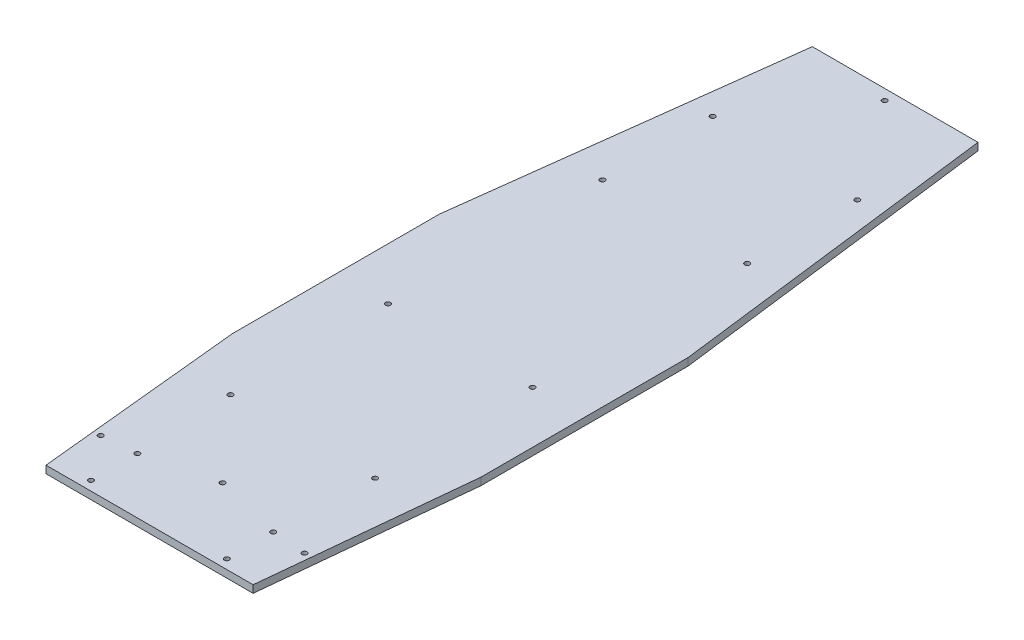
ISO-10303-21;
HEADER;
FILE_DESCRIPTION(('STEP AP214'),'2;1');
FILE_NAME('part.step','',(''),(''),'','','');
FILE_SCHEMA(('AUTOMOTIVE_DESIGN { 1 0 10303 214 1 1 1 1 }'));
ENDSEC;
DATA;
#1=APPLICATION_CONTEXT('core data for automotive mechanical design processes');
#2=APPLICATION_PROTOCOL_DEFINITION('international standard','automotive_design',2000,#1);
#3=PRODUCT_CONTEXT('',#1,'mechanical');
#4=PRODUCT('Part','Part','',(#3));
#5=PRODUCT_RELATED_PRODUCT_CATEGORY('part','',(#4));
#6=PRODUCT_DEFINITION_FORMATION('','',#4);
#7=PRODUCT_DEFINITION_CONTEXT('part definition',#1,'design');
#8=PRODUCT_DEFINITION('design','',#6,#7);
#9=PRODUCT_DEFINITION_SHAPE('','',#8);
#10=(LENGTH_UNIT() NAMED_UNIT(*) SI_UNIT(.MILLI.,.METRE.));
#11=(NAMED_UNIT(*) PLANE_ANGLE_UNIT() SI_UNIT($,.RADIAN.));
#12=(NAMED_UNIT(*) SI_UNIT($,.STERADIAN.) SOLID_ANGLE_UNIT());
#13=UNCERTAINTY_MEASURE_WITH_UNIT(LENGTH_MEASURE(1.E-05),#10,'distance_accuracy_value','');
#14=(GEOMETRIC_REPRESENTATION_CONTEXT(3) GLOBAL_UNCERTAINTY_ASSIGNED_CONTEXT((#13)) GLOBAL_UNIT_ASSIGNED_CONTEXT((#10,
#11,#12)) REPRESENTATION_CONTEXT('',''));
#15=CARTESIAN_POINT('',(0.,0.,0.));
#16=DIRECTION('',(0.,0.,1.));
#17=DIRECTION('',(1.,0.,0.));
#18=AXIS2_PLACEMENT_3D('',#15,#16,#17);
#19=CARTESIAN_POINT('',(150.,9.,-125.));
#20=DIRECTION('',(-0.992277876713668,0.,0.124034734589209));
#21=DIRECTION('',(0.124034734589209,0.,0.992277876713668));
#22=AXIS2_PLACEMENT_3D('',#19,#20,#21);
#23=PLANE('',#22);
#24=DIRECTION('',(-0.124034734589209,0.,-0.992277876713668));
#25=VECTOR('',#24,1.);
#26=CARTESIAN_POINT('',(150.,0.,-125.));
#27=LINE('',#26,#25);
#28=CARTESIAN_POINT('',(150.,0.,-125.));
#29=VERTEX_POINT('',#28);
#30=CARTESIAN_POINT('',(100.,0.,-525.));
#31=VERTEX_POINT('',#30);
#32=EDGE_CURVE('E143',#29,#31,#27,.T.);
#33=ORIENTED_EDGE('',*,*,#32,.T.);
#34=DIRECTION('',(0.,-1.,0.));
#35=VECTOR('',#34,1.);
#36=CARTESIAN_POINT('',(100.,9.,-525.));
#37=LINE('',#36,#35);
#38=CARTESIAN_POINT('',(100.,9.,-525.));
#39=VERTEX_POINT('',#38);
#40=EDGE_CURVE('E11',#39,#31,#37,.T.);
#41=ORIENTED_EDGE('',*,*,#40,.F.);
#42=DIRECTION('',(-0.124034734589209,0.,-0.992277876713668));
#43=VECTOR('',#42,1.);
#44=CARTESIAN_POINT('',(150.,9.,-125.));
#45=LINE('',#44,#43);
#46=CARTESIAN_POINT('',(150.,9.,-125.));
#47=VERTEX_POINT('',#46);
#48=EDGE_CURVE('E158',#47,#39,#45,.T.);
#49=ORIENTED_EDGE('',*,*,#48,.F.);
#50=DIRECTION('',(0.,-1.,0.));
#51=VECTOR('',#50,1.);
#52=CARTESIAN_POINT('',(150.,9.,-125.));
#53=LINE('',#52,#51);
#54=EDGE_CURVE('E139',#47,#29,#53,.T.);
#55=ORIENTED_EDGE('',*,*,#54,.T.);
#56=EDGE_LOOP('',(#33,#41,#49,#55));
#57=FACE_BOUND('',#56,.T.);
#58=ADVANCED_FACE('F47',(#57),#23,.F.);
#59=CARTESIAN_POINT('',(-99.9999999999999,9.,-525.));
#60=DIRECTION('',(0.,0.,1.));
#61=DIRECTION('',(1.,0.,0.));
#62=AXIS2_PLACEMENT_3D('',#59,#60,#61);
#63=PLANE('',#62);
#64=DIRECTION('',(-1.,0.,0.));
#65=VECTOR('',#64,1.);
#66=CARTESIAN_POINT('',(-99.9999999999999,0.,-525.));
#67=LINE('',#66,#65);
#68=CARTESIAN_POINT('',(-99.9999999999999,0.,-525.));
#69=VERTEX_POINT('',#68);
#70=EDGE_CURVE('E146',#31,#69,#67,.T.);
#71=ORIENTED_EDGE('',*,*,#70,.T.);
#72=DIRECTION('',(0.,-1.,0.));
#73=VECTOR('',#72,1.);
#74=CARTESIAN_POINT('',(-99.9999999999999,9.,-525.));
#75=LINE('',#74,#73);
#76=CARTESIAN_POINT('',(-99.9999999999999,9.,-525.));
#77=VERTEX_POINT('',#76);
#78=EDGE_CURVE('E55',#77,#69,#75,.T.);
#79=ORIENTED_EDGE('',*,*,#78,.F.);
#80=DIRECTION('',(-1.,0.,0.));
#81=VECTOR('',#80,1.);
#82=CARTESIAN_POINT('',(-99.9999999999999,9.,-525.));
#83=LINE('',#82,#81);
#84=EDGE_CURVE('E106',#39,#77,#83,.T.);
#85=ORIENTED_EDGE('',*,*,#84,.F.);
#86=ORIENTED_EDGE('',*,*,#40,.T.);
#87=EDGE_LOOP('',(#71,#79,#85,#86));
#88=FACE_BOUND('',#87,.T.);
#89=ADVANCED_FACE('F401',(#88),#63,.F.);
#90=CARTESIAN_POINT('',(-99.9999999999999,9.,-525.));
#91=DIRECTION('',(0.992277876713668,0.,0.124034734589208));
#92=DIRECTION('',(0.124034734589208,0.,-0.992277876713668));
#93=AXIS2_PLACEMENT_3D('',#90,#91,#92);
#94=PLANE('',#93);
#95=DIRECTION('',(-0.124034734589208,0.,0.992277876713668));
#96=VECTOR('',#95,1.);
#97=CARTESIAN_POINT('',(-99.9999999999999,0.,-525.));
#98=LINE('',#97,#96);
#99=CARTESIAN_POINT('',(-150.,0.,-125.));
#100=VERTEX_POINT('',#99);
#101=EDGE_CURVE('E149',#69,#100,#98,.T.);
#102=ORIENTED_EDGE('',*,*,#101,.T.);
#103=DIRECTION('',(0.,-1.,0.));
#104=VECTOR('',#103,1.);
#105=CARTESIAN_POINT('',(-150.,9.,-125.));
#106=LINE('',#105,#104);
#107=CARTESIAN_POINT('',(-150.,9.,-125.));
#108=VERTEX_POINT('',#107);
#109=EDGE_CURVE('E165',#108,#100,#106,.T.);
#110=ORIENTED_EDGE('',*,*,#109,.F.);
#111=DIRECTION('',(-0.124034734589208,0.,0.992277876713668));
#112=VECTOR('',#111,1.);
#113=CARTESIAN_POINT('',(-99.9999999999999,9.,-525.));
#114=LINE('',#113,#112);
#115=EDGE_CURVE('E173',#77,#108,#114,.T.);
#116=ORIENTED_EDGE('',*,*,#115,.F.);
#117=ORIENTED_EDGE('',*,*,#78,.T.);
#118=EDGE_LOOP('',(#102,#110,#116,#117));
#119=FACE_BOUND('',#118,.T.);
#120=ADVANCED_FACE('F171',(#119),#94,.F.);
#121=CARTESIAN_POINT('',(-150.,9.,125.));
#122=DIRECTION('',(1.,0.,0.));
#123=DIRECTION('',(0.,0.,-1.));
#124=AXIS2_PLACEMENT_3D('',#121,#122,#123);
#125=PLANE('',#124);
#126=DIRECTION('',(0.,0.,1.));
#127=VECTOR('',#126,1.);
#128=CARTESIAN_POINT('',(-150.,0.,125.));
#129=LINE('',#128,#127);
#130=CARTESIAN_POINT('',(-150.,0.,125.));
#131=VERTEX_POINT('',#130);
#132=EDGE_CURVE('E151',#100,#131,#129,.T.);
#133=ORIENTED_EDGE('',*,*,#132,.T.);
#134=DIRECTION('',(0.,-1.,0.));
#135=VECTOR('',#134,1.);
#136=CARTESIAN_POINT('',(-150.,9.,125.));
#137=LINE('',#136,#135);
#138=CARTESIAN_POINT('',(-150.,9.,125.));
#139=VERTEX_POINT('',#138);
#140=EDGE_CURVE('E162',#139,#131,#137,.T.);
#141=ORIENTED_EDGE('',*,*,#140,.F.);
#142=DIRECTION('',(0.,0.,1.));
#143=VECTOR('',#142,1.);
#144=CARTESIAN_POINT('',(-150.,9.,125.));
#145=LINE('',#144,#143);
#146=EDGE_CURVE('E185',#108,#139,#145,.T.);
#147=ORIENTED_EDGE('',*,*,#146,.F.);
#148=ORIENTED_EDGE('',*,*,#109,.T.);
#149=EDGE_LOOP('',(#133,#141,#147,#148));
#150=FACE_BOUND('',#149,.T.);
#151=ADVANCED_FACE('F181',(#150),#125,.F.);
#152=CARTESIAN_POINT('',(-150.,9.,125.));
#153=DIRECTION('',(0.995037190209989,0.,-0.0995037190209991));
#154=DIRECTION('',(-0.0995037190209991,0.,-0.995037190209989));
#155=AXIS2_PLACEMENT_3D('',#152,#153,#154);
#156=PLANE('',#155);
#157=DIRECTION('',(0.0995037190209991,0.,0.995037190209989));
#158=VECTOR('',#157,1.);
#159=CARTESIAN_POINT('',(-150.,0.,125.));
#160=LINE('',#159,#158);
#161=CARTESIAN_POINT('',(-125.,0.,375.));
#162=VERTEX_POINT('',#161);
#163=EDGE_CURVE('E153',#131,#162,#160,.T.);
#164=ORIENTED_EDGE('',*,*,#163,.T.);
#165=DIRECTION('',(0.,-1.,0.));
#166=VECTOR('',#165,1.);
#167=CARTESIAN_POINT('',(-125.,9.,375.));
#168=LINE('',#167,#166);
#169=CARTESIAN_POINT('',(-125.,9.,375.));
#170=VERTEX_POINT('',#169);
#171=EDGE_CURVE('E134',#170,#162,#168,.T.);
#172=ORIENTED_EDGE('',*,*,#171,.F.);
#173=DIRECTION('',(0.0995037190209991,0.,0.995037190209989));
#174=VECTOR('',#173,1.);
#175=CARTESIAN_POINT('',(-150.,9.,125.));
#176=LINE('',#175,#174);
#177=EDGE_CURVE('E125',#139,#170,#176,.T.);
#178=ORIENTED_EDGE('',*,*,#177,.F.);
#179=ORIENTED_EDGE('',*,*,#140,.T.);
#180=EDGE_LOOP('',(#164,#172,#178,#179));
#181=FACE_BOUND('',#180,.T.);
#182=ADVANCED_FACE('F184',(#181),#156,.F.);
#183=CARTESIAN_POINT('',(-125.,9.,375.));
#184=DIRECTION('',(0.,0.,-1.));
#185=DIRECTION('',(-1.,0.,0.));
#186=AXIS2_PLACEMENT_3D('',#183,#184,#185);
#187=PLANE('',#186);
#188=DIRECTION('',(1.,0.,0.));
#189=VECTOR('',#188,1.);
#190=CARTESIAN_POINT('',(-125.,0.,375.));
#191=LINE('',#190,#189);
#192=CARTESIAN_POINT('',(125.,0.,375.));
#193=VERTEX_POINT('',#192);
#194=EDGE_CURVE('E133',#162,#193,#191,.T.);
#195=ORIENTED_EDGE('',*,*,#194,.T.);
#196=DIRECTION('',(0.,-1.,0.));
#197=VECTOR('',#196,1.);
#198=CARTESIAN_POINT('',(125.,9.,375.));
#199=LINE('',#198,#197);
#200=CARTESIAN_POINT('',(125.,9.,375.));
#201=VERTEX_POINT('',#200);
#202=EDGE_CURVE('E130',#201,#193,#199,.T.);
#203=ORIENTED_EDGE('',*,*,#202,.F.);
#204=DIRECTION('',(1.,0.,0.));
#205=VECTOR('',#204,1.);
#206=CARTESIAN_POINT('',(-125.,9.,375.));
#207=LINE('',#206,#205);
#208=EDGE_CURVE('E119',#170,#201,#207,.T.);
#209=ORIENTED_EDGE('',*,*,#208,.F.);
#210=ORIENTED_EDGE('',*,*,#171,.T.);
#211=EDGE_LOOP('',(#195,#203,#209,#210));
#212=FACE_BOUND('',#211,.T.);
#213=ADVANCED_FACE('F131',(#212),#187,.F.);
#214=CARTESIAN_POINT('',(125.,9.,375.));
#215=DIRECTION('',(-0.995037190209989,0.,-0.0995037190209987));
#216=DIRECTION('',(-0.0995037190209987,0.,0.995037190209989));
#217=AXIS2_PLACEMENT_3D('',#214,#215,#216);
#218=PLANE('',#217);
#219=DIRECTION('',(0.0995037190209987,0.,-0.995037190209989));
#220=VECTOR('',#219,1.);
#221=CARTESIAN_POINT('',(125.,0.,375.));
#222=LINE('',#221,#220);
#223=CARTESIAN_POINT('',(150.,0.,125.));
#224=VERTEX_POINT('',#223);
#225=EDGE_CURVE('E92',#193,#224,#222,.T.);
#226=ORIENTED_EDGE('',*,*,#225,.T.);
#227=DIRECTION('',(0.,-1.,0.));
#228=VECTOR('',#227,1.);
#229=CARTESIAN_POINT('',(150.,9.,125.));
#230=LINE('',#229,#228);
#231=CARTESIAN_POINT('',(150.,9.,125.));
#232=VERTEX_POINT('',#231);
#233=EDGE_CURVE('E135',#232,#224,#230,.T.);
#234=ORIENTED_EDGE('',*,*,#233,.F.);
#235=DIRECTION('',(0.0995037190209987,0.,-0.995037190209989));
#236=VECTOR('',#235,1.);
#237=CARTESIAN_POINT('',(125.,9.,375.));
#238=LINE('',#237,#236);
#239=EDGE_CURVE('E123',#201,#232,#238,.T.);
#240=ORIENTED_EDGE('',*,*,#239,.F.);
#241=ORIENTED_EDGE('',*,*,#202,.T.);
#242=EDGE_LOOP('',(#226,#234,#240,#241));
#243=FACE_BOUND('',#242,.T.);
#244=ADVANCED_FACE('F137',(#243),#218,.F.);
#245=CARTESIAN_POINT('',(150.,9.,125.));
#246=DIRECTION('',(-1.,0.,0.));
#247=DIRECTION('',(0.,0.,1.));
#248=AXIS2_PLACEMENT_3D('',#245,#246,#247);
#249=PLANE('',#248);
#250=DIRECTION('',(0.,0.,-1.));
#251=VECTOR('',#250,1.);
#252=CARTESIAN_POINT('',(150.,0.,125.));
#253=LINE('',#252,#251);
#254=EDGE_CURVE('E98',#224,#29,#253,.T.);
#255=ORIENTED_EDGE('',*,*,#254,.T.);
#256=ORIENTED_EDGE('',*,*,#54,.F.);
#257=DIRECTION('',(0.,0.,-1.));
#258=VECTOR('',#257,1.);
#259=CARTESIAN_POINT('',(150.,9.,125.));
#260=LINE('',#259,#258);
#261=EDGE_CURVE('E63',#232,#47,#260,.T.);
#262=ORIENTED_EDGE('',*,*,#261,.F.);
#263=ORIENTED_EDGE('',*,*,#233,.T.);
#264=EDGE_LOOP('',(#255,#256,#262,#263));
#265=FACE_BOUND('',#264,.T.);
#266=ADVANCED_FACE('F352',(#265),#249,.F.);
#267=CARTESIAN_POINT('',(0.,9.,0.));
#268=DIRECTION('',(0.,-1.,0.));
#269=DIRECTION('',(0.,0.,-1.));
#270=AXIS2_PLACEMENT_3D('',#267,#268,#269);
#271=PLANE('',#270);
#272=CARTESIAN_POINT('',(-82.0000000001843,9.,363.750000000078));
#273=DIRECTION('',(0.,1.,0.));
#274=DIRECTION('',(0.,0.,1.));
#275=AXIS2_PLACEMENT_3D('',#272,#273,#274);
#276=CIRCLE('',#275,2.99999999999999);
#277=CARTESIAN_POINT('',(-82.0000000001843,9.,366.750000000078));
#278=VERTEX_POINT('',#277);
#279=EDGE_CURVE('E328',#278,#278,#276,.T.);
#280=ORIENTED_EDGE('',*,*,#279,.F.);
#281=EDGE_LOOP('',(#280));
#282=FACE_BOUND('',#281,.T.);
#283=CARTESIAN_POINT('',(-82.0000000001849,9.,307.750000000078));
#284=DIRECTION('',(0.,1.,0.));
#285=DIRECTION('',(0.,0.,1.));
#286=AXIS2_PLACEMENT_3D('',#283,#284,#285);
#287=CIRCLE('',#286,2.99999999999999);
#288=CARTESIAN_POINT('',(-82.0000000001849,9.,310.750000000078));
#289=VERTEX_POINT('',#288);
#290=EDGE_CURVE('E319',#289,#289,#287,.T.);
#291=ORIENTED_EDGE('',*,*,#290,.F.);
#292=EDGE_LOOP('',(#291));
#293=FACE_BOUND('',#292,.T.);
#294=CARTESIAN_POINT('',(81.9999999998091,9.,363.750000000079));
#295=DIRECTION('',(0.,1.,0.));
#296=DIRECTION('',(0.,0.,1.));
#297=AXIS2_PLACEMENT_3D('',#294,#295,#296);
#298=CIRCLE('',#297,2.99999999999999);
#299=CARTESIAN_POINT('',(81.9999999998091,9.,366.750000000079));
#300=VERTEX_POINT('',#299);
#301=EDGE_CURVE('E310',#300,#300,#298,.T.);
#302=ORIENTED_EDGE('',*,*,#301,.F.);
#303=EDGE_LOOP('',(#302));
#304=FACE_BOUND('',#303,.T.);
#305=CARTESIAN_POINT('',(81.9999999998089,9.,307.750000000079));
#306=DIRECTION('',(0.,1.,0.));
#307=DIRECTION('',(0.,0.,1.));
#308=AXIS2_PLACEMENT_3D('',#305,#306,#307);
#309=CIRCLE('',#308,2.99999999999999);
#310=CARTESIAN_POINT('',(81.9999999998089,9.,310.750000000079));
#311=VERTEX_POINT('',#310);
#312=EDGE_CURVE('E301',#311,#311,#309,.T.);
#313=ORIENTED_EDGE('',*,*,#312,.F.);
#314=EDGE_LOOP('',(#313));
#315=FACE_BOUND('',#314,.T.);
#316=CARTESIAN_POINT('',(123.000000000002,9.,310.999999999999));
#317=DIRECTION('',(0.,1.,0.));
#318=DIRECTION('',(0.,0.,1.));
#319=AXIS2_PLACEMENT_3D('',#316,#317,#318);
#320=CIRCLE('',#319,2.99999999999999);
#321=CARTESIAN_POINT('',(123.000000000002,9.,313.999999999999));
#322=VERTEX_POINT('',#321);
#323=EDGE_CURVE('E292',#322,#322,#320,.T.);
#324=ORIENTED_EDGE('',*,*,#323,.F.);
#325=EDGE_LOOP('',(#324));
#326=FACE_BOUND('',#325,.T.);
#327=CARTESIAN_POINT('',(-123.000000000189,9.,311.000000000087));
#328=DIRECTION('',(0.,1.,0.));
#329=DIRECTION('',(0.,0.,1.));
#330=AXIS2_PLACEMENT_3D('',#327,#328,#329);
#331=CIRCLE('',#330,2.99999999999999);
#332=CARTESIAN_POINT('',(-123.000000000189,9.,314.000000000087));
#333=VERTEX_POINT('',#332);
#334=EDGE_CURVE('E283',#333,#333,#331,.T.);
#335=ORIENTED_EDGE('',*,*,#334,.F.);
#336=EDGE_LOOP('',(#335));
#337=FACE_BOUND('',#336,.T.);
#338=CARTESIAN_POINT('',(0.,9.,-512.3));
#339=DIRECTION('',(0.,1.,0.));
#340=DIRECTION('',(0.,0.,1.));
#341=AXIS2_PLACEMENT_3D('',#338,#339,#340);
#342=CIRCLE('',#341,2.99999999999999);
#343=CARTESIAN_POINT('',(0.,9.,-509.3));
#344=VERTEX_POINT('',#343);
#345=EDGE_CURVE('E274',#344,#344,#342,.T.);
#346=ORIENTED_EDGE('',*,*,#345,.F.);
#347=EDGE_LOOP('',(#346));
#348=FACE_BOUND('',#347,.T.);
#349=CARTESIAN_POINT('',(-87.2999999999999,9.,-392.));
#350=DIRECTION('',(0.,1.,0.));
#351=DIRECTION('',(0.,0.,1.));
#352=AXIS2_PLACEMENT_3D('',#349,#350,#351);
#353=CIRCLE('',#352,2.99999999999999);
#354=CARTESIAN_POINT('',(-87.2999999999999,9.,-389.));
#355=VERTEX_POINT('',#354);
#356=EDGE_CURVE('E265',#355,#355,#353,.T.);
#357=ORIENTED_EDGE('',*,*,#356,.F.);
#358=EDGE_LOOP('',(#357));
#359=FACE_BOUND('',#358,.T.);
#360=CARTESIAN_POINT('',(-87.2999999999999,9.,-259.));
#361=DIRECTION('',(0.,1.,0.));
#362=DIRECTION('',(0.,0.,1.));
#363=AXIS2_PLACEMENT_3D('',#360,#361,#362);
#364=CIRCLE('',#363,2.99999999999999);
#365=CARTESIAN_POINT('',(-87.2999999999999,9.,-256.));
#366=VERTEX_POINT('',#365);
#367=EDGE_CURVE('E256',#366,#366,#364,.T.);
#368=ORIENTED_EDGE('',*,*,#367,.F.);
#369=EDGE_LOOP('',(#368));
#370=FACE_BOUND('',#369,.T.);
#371=CARTESIAN_POINT('',(87.3000000000001,9.,-259.));
#372=DIRECTION('',(0.,1.,0.));
#373=DIRECTION('',(0.,0.,1.));
#374=AXIS2_PLACEMENT_3D('',#371,#372,#373);
#375=CIRCLE('',#374,2.99999999999999);
#376=CARTESIAN_POINT('',(87.3000000000001,9.,-256.));
#377=VERTEX_POINT('',#376);
#378=EDGE_CURVE('E247',#377,#377,#375,.T.);
#379=ORIENTED_EDGE('',*,*,#378,.F.);
#380=EDGE_LOOP('',(#379));
#381=FACE_BOUND('',#380,.T.);
#382=CARTESIAN_POINT('',(87.3000000000001,9.,-392.));
#383=DIRECTION('',(0.,1.,0.));
#384=DIRECTION('',(0.,0.,1.));
#385=AXIS2_PLACEMENT_3D('',#382,#383,#384);
#386=CIRCLE('',#385,2.99999999999999);
#387=CARTESIAN_POINT('',(87.3000000000001,9.,-389.));
#388=VERTEX_POINT('',#387);
#389=EDGE_CURVE('E238',#388,#388,#386,.T.);
#390=ORIENTED_EDGE('',*,*,#389,.F.);
#391=EDGE_LOOP('',(#390));
#392=FACE_BOUND('',#391,.T.);
#393=CARTESIAN_POINT('',(87.3000000000001,9.,0.));
#394=DIRECTION('',(0.,1.,0.));
#395=DIRECTION('',(0.,0.,1.));
#396=AXIS2_PLACEMENT_3D('',#393,#394,#395);
#397=CIRCLE('',#396,2.99999999999999);
#398=CARTESIAN_POINT('',(87.3000000000001,9.,2.99999999999999));
#399=VERTEX_POINT('',#398);
#400=EDGE_CURVE('E229',#399,#399,#397,.T.);
#401=ORIENTED_EDGE('',*,*,#400,.F.);
#402=EDGE_LOOP('',(#401));
#403=FACE_BOUND('',#402,.T.);
#404=CARTESIAN_POINT('',(-87.2999999999999,9.,0.));
#405=DIRECTION('',(0.,1.,0.));
#406=DIRECTION('',(0.,0.,1.));
#407=AXIS2_PLACEMENT_3D('',#404,#405,#406);
#408=CIRCLE('',#407,2.99999999999999);
#409=CARTESIAN_POINT('',(-87.2999999999999,9.,2.99999999999999));
#410=VERTEX_POINT('',#409);
#411=EDGE_CURVE('E220',#410,#410,#408,.T.);
#412=ORIENTED_EDGE('',*,*,#411,.F.);
#413=EDGE_LOOP('',(#412));
#414=FACE_BOUND('',#413,.T.);
#415=CARTESIAN_POINT('',(-87.2999999999999,9.,190.));
#416=DIRECTION('',(0.,1.,0.));
#417=DIRECTION('',(0.,0.,1.));
#418=AXIS2_PLACEMENT_3D('',#415,#416,#417);
#419=CIRCLE('',#418,2.99999999999999);
#420=CARTESIAN_POINT('',(-87.2999999999999,9.,193.));
#421=VERTEX_POINT('',#420);
#422=EDGE_CURVE('E211',#421,#421,#419,.T.);
#423=ORIENTED_EDGE('',*,*,#422,.F.);
#424=EDGE_LOOP('',(#423));
#425=FACE_BOUND('',#424,.T.);
#426=CARTESIAN_POINT('',(87.3000000000002,9.,190.));
#427=DIRECTION('',(0.,1.,0.));
#428=DIRECTION('',(0.,0.,1.));
#429=AXIS2_PLACEMENT_3D('',#426,#427,#428);
#430=CIRCLE('',#429,2.99999999999999);
#431=CARTESIAN_POINT('',(87.3000000000002,9.,193.));
#432=VERTEX_POINT('',#431);
#433=EDGE_CURVE('E202',#432,#432,#430,.T.);
#434=ORIENTED_EDGE('',*,*,#433,.F.);
#435=EDGE_LOOP('',(#434));
#436=FACE_BOUND('',#435,.T.);
#437=CARTESIAN_POINT('',(2.35922392732846E-13,9.,286.8));
#438=DIRECTION('',(0.,1.,0.));
#439=DIRECTION('',(0.,0.,1.));
#440=AXIS2_PLACEMENT_3D('',#437,#438,#439);
#441=CIRCLE('',#440,2.99999999999999);
#442=CARTESIAN_POINT('',(2.35922392732846E-13,9.,289.8));
#443=VERTEX_POINT('',#442);
#444=EDGE_CURVE('E193',#443,#443,#441,.T.);
#445=ORIENTED_EDGE('',*,*,#444,.F.);
#446=EDGE_LOOP('',(#445));
#447=FACE_BOUND('',#446,.T.);
#448=ORIENTED_EDGE('',*,*,#48,.T.);
#449=ORIENTED_EDGE('',*,*,#84,.T.);
#450=ORIENTED_EDGE('',*,*,#115,.T.);
#451=ORIENTED_EDGE('',*,*,#146,.T.);
#452=ORIENTED_EDGE('',*,*,#177,.T.);
#453=ORIENTED_EDGE('',*,*,#208,.T.);
#454=ORIENTED_EDGE('',*,*,#239,.T.);
#455=ORIENTED_EDGE('',*,*,#261,.T.);
#456=EDGE_LOOP('',(#448,#449,#450,#451,#452,#453,#454,#455));
#457=FACE_BOUND('',#456,.T.);
#458=ADVANCED_FACE('F121',(#282,#293,#304,#315,#326,#337,#348,#359,#370,#381,#392,#403,#414,
#425,#436,#447,#457),#271,.F.);
#459=CARTESIAN_POINT('',(0.,0.,0.));
#460=DIRECTION('',(0.,-1.,0.));
#461=DIRECTION('',(0.,0.,-1.));
#462=AXIS2_PLACEMENT_3D('',#459,#460,#461);
#463=PLANE('',#462);
#464=CARTESIAN_POINT('',(-82.0000000001843,0.,363.750000000078));
#465=DIRECTION('',(0.,1.,0.));
#466=DIRECTION('',(0.,0.,1.));
#467=AXIS2_PLACEMENT_3D('',#464,#465,#466);
#468=CIRCLE('',#467,5.99999999999999);
#469=CARTESIAN_POINT('',(-82.0000000001843,0.,369.750000000078));
#470=VERTEX_POINT('',#469);
#471=EDGE_CURVE('E331',#470,#470,#468,.T.);
#472=ORIENTED_EDGE('',*,*,#471,.T.);
#473=EDGE_LOOP('',(#472));
#474=FACE_BOUND('',#473,.T.);
#475=CARTESIAN_POINT('',(-82.0000000001849,0.,307.750000000078));
#476=DIRECTION('',(0.,1.,0.));
#477=DIRECTION('',(0.,0.,1.));
#478=AXIS2_PLACEMENT_3D('',#475,#476,#477);
#479=CIRCLE('',#478,5.99999999999999);
#480=CARTESIAN_POINT('',(-82.0000000001849,0.,313.750000000078));
#481=VERTEX_POINT('',#480);
#482=EDGE_CURVE('E322',#481,#481,#479,.T.);
#483=ORIENTED_EDGE('',*,*,#482,.T.);
#484=EDGE_LOOP('',(#483));
#485=FACE_BOUND('',#484,.T.);
#486=CARTESIAN_POINT('',(81.9999999998091,0.,363.750000000079));
#487=DIRECTION('',(0.,1.,0.));
#488=DIRECTION('',(0.,0.,1.));
#489=AXIS2_PLACEMENT_3D('',#486,#487,#488);
#490=CIRCLE('',#489,5.99999999999999);
#491=CARTESIAN_POINT('',(81.9999999998091,0.,369.750000000079));
#492=VERTEX_POINT('',#491);
#493=EDGE_CURVE('E313',#492,#492,#490,.T.);
#494=ORIENTED_EDGE('',*,*,#493,.T.);
#495=EDGE_LOOP('',(#494));
#496=FACE_BOUND('',#495,.T.);
#497=CARTESIAN_POINT('',(81.9999999998089,0.,307.750000000079));
#498=DIRECTION('',(0.,1.,0.));
#499=DIRECTION('',(0.,0.,1.));
#500=AXIS2_PLACEMENT_3D('',#497,#498,#499);
#501=CIRCLE('',#500,5.99999999999999);
#502=CARTESIAN_POINT('',(81.9999999998089,0.,313.750000000079));
#503=VERTEX_POINT('',#502);
#504=EDGE_CURVE('E304',#503,#503,#501,.T.);
#505=ORIENTED_EDGE('',*,*,#504,.T.);
#506=EDGE_LOOP('',(#505));
#507=FACE_BOUND('',#506,.T.);
#508=CARTESIAN_POINT('',(123.000000000002,0.,310.999999999999));
#509=DIRECTION('',(0.,1.,0.));
#510=DIRECTION('',(0.,0.,1.));
#511=AXIS2_PLACEMENT_3D('',#508,#509,#510);
#512=CIRCLE('',#511,5.99999999999999);
#513=CARTESIAN_POINT('',(123.000000000002,0.,316.999999999999));
#514=VERTEX_POINT('',#513);
#515=EDGE_CURVE('E295',#514,#514,#512,.T.);
#516=ORIENTED_EDGE('',*,*,#515,.T.);
#517=EDGE_LOOP('',(#516));
#518=FACE_BOUND('',#517,.T.);
#519=CARTESIAN_POINT('',(-123.000000000189,0.,311.000000000087));
#520=DIRECTION('',(0.,1.,0.));
#521=DIRECTION('',(0.,0.,1.));
#522=AXIS2_PLACEMENT_3D('',#519,#520,#521);
#523=CIRCLE('',#522,5.99999999999999);
#524=CARTESIAN_POINT('',(-123.000000000189,0.,317.000000000087));
#525=VERTEX_POINT('',#524);
#526=EDGE_CURVE('E286',#525,#525,#523,.T.);
#527=ORIENTED_EDGE('',*,*,#526,.T.);
#528=EDGE_LOOP('',(#527));
#529=FACE_BOUND('',#528,.T.);
#530=CARTESIAN_POINT('',(0.,0.,-512.3));
#531=DIRECTION('',(0.,1.,0.));
#532=DIRECTION('',(0.,0.,1.));
#533=AXIS2_PLACEMENT_3D('',#530,#531,#532);
#534=CIRCLE('',#533,6.);
#535=CARTESIAN_POINT('',(0.,0.,-506.3));
#536=VERTEX_POINT('',#535);
#537=EDGE_CURVE('E277',#536,#536,#534,.T.);
#538=ORIENTED_EDGE('',*,*,#537,.T.);
#539=EDGE_LOOP('',(#538));
#540=FACE_BOUND('',#539,.T.);
#541=CARTESIAN_POINT('',(-87.2999999999999,0.,-392.));
#542=DIRECTION('',(0.,1.,0.));
#543=DIRECTION('',(0.,0.,1.));
#544=AXIS2_PLACEMENT_3D('',#541,#542,#543);
#545=CIRCLE('',#544,6.00000000000001);
#546=CARTESIAN_POINT('',(-87.2999999999999,0.,-386.));
#547=VERTEX_POINT('',#546);
#548=EDGE_CURVE('E268',#547,#547,#545,.T.);
#549=ORIENTED_EDGE('',*,*,#548,.T.);
#550=EDGE_LOOP('',(#549));
#551=FACE_BOUND('',#550,.T.);
#552=CARTESIAN_POINT('',(-87.2999999999999,0.,-259.));
#553=DIRECTION('',(0.,1.,0.));
#554=DIRECTION('',(0.,0.,1.));
#555=AXIS2_PLACEMENT_3D('',#552,#553,#554);
#556=CIRCLE('',#555,6.00000000000001);
#557=CARTESIAN_POINT('',(-87.2999999999999,0.,-253.));
#558=VERTEX_POINT('',#557);
#559=EDGE_CURVE('E259',#558,#558,#556,.T.);
#560=ORIENTED_EDGE('',*,*,#559,.T.);
#561=EDGE_LOOP('',(#560));
#562=FACE_BOUND('',#561,.T.);
#563=CARTESIAN_POINT('',(87.3000000000001,0.,-259.));
#564=DIRECTION('',(0.,1.,0.));
#565=DIRECTION('',(0.,0.,1.));
#566=AXIS2_PLACEMENT_3D('',#563,#564,#565);
#567=CIRCLE('',#566,6.00000000000001);
#568=CARTESIAN_POINT('',(87.3000000000001,0.,-253.));
#569=VERTEX_POINT('',#568);
#570=EDGE_CURVE('E250',#569,#569,#567,.T.);
#571=ORIENTED_EDGE('',*,*,#570,.T.);
#572=EDGE_LOOP('',(#571));
#573=FACE_BOUND('',#572,.T.);
#574=CARTESIAN_POINT('',(87.3000000000001,0.,-392.));
#575=DIRECTION('',(0.,1.,0.));
#576=DIRECTION('',(0.,0.,1.));
#577=AXIS2_PLACEMENT_3D('',#574,#575,#576);
#578=CIRCLE('',#577,6.00000000000001);
#579=CARTESIAN_POINT('',(87.3000000000001,0.,-386.));
#580=VERTEX_POINT('',#579);
#581=EDGE_CURVE('E241',#580,#580,#578,.T.);
#582=ORIENTED_EDGE('',*,*,#581,.T.);
#583=EDGE_LOOP('',(#582));
#584=FACE_BOUND('',#583,.T.);
#585=CARTESIAN_POINT('',(87.3000000000001,0.,0.));
#586=DIRECTION('',(0.,1.,0.));
#587=DIRECTION('',(0.,0.,1.));
#588=AXIS2_PLACEMENT_3D('',#585,#586,#587);
#589=CIRCLE('',#588,6.00000000000001);
#590=CARTESIAN_POINT('',(87.3000000000001,0.,6.00000000000001));
#591=VERTEX_POINT('',#590);
#592=EDGE_CURVE('E232',#591,#591,#589,.T.);
#593=ORIENTED_EDGE('',*,*,#592,.T.);
#594=EDGE_LOOP('',(#593));
#595=FACE_BOUND('',#594,.T.);
#596=CARTESIAN_POINT('',(-87.2999999999999,0.,0.));
#597=DIRECTION('',(0.,1.,0.));
#598=DIRECTION('',(0.,0.,1.));
#599=AXIS2_PLACEMENT_3D('',#596,#597,#598);
#600=CIRCLE('',#599,6.00000000000001);
#601=CARTESIAN_POINT('',(-87.2999999999999,0.,6.00000000000001));
#602=VERTEX_POINT('',#601);
#603=EDGE_CURVE('E223',#602,#602,#600,.T.);
#604=ORIENTED_EDGE('',*,*,#603,.T.);
#605=EDGE_LOOP('',(#604));
#606=FACE_BOUND('',#605,.T.);
#607=CARTESIAN_POINT('',(-87.2999999999999,0.,190.));
#608=DIRECTION('',(0.,1.,0.));
#609=DIRECTION('',(0.,0.,1.));
#610=AXIS2_PLACEMENT_3D('',#607,#608,#609);
#611=CIRCLE('',#610,6.00000000000001);
#612=CARTESIAN_POINT('',(-87.2999999999999,0.,196.));
#613=VERTEX_POINT('',#612);
#614=EDGE_CURVE('E214',#613,#613,#611,.T.);
#615=ORIENTED_EDGE('',*,*,#614,.T.);
#616=EDGE_LOOP('',(#615));
#617=FACE_BOUND('',#616,.T.);
#618=CARTESIAN_POINT('',(87.3000000000002,0.,190.));
#619=DIRECTION('',(0.,1.,0.));
#620=DIRECTION('',(0.,0.,1.));
#621=AXIS2_PLACEMENT_3D('',#618,#619,#620);
#622=CIRCLE('',#621,6.00000000000001);
#623=CARTESIAN_POINT('',(87.3000000000002,0.,196.));
#624=VERTEX_POINT('',#623);
#625=EDGE_CURVE('E205',#624,#624,#622,.T.);
#626=ORIENTED_EDGE('',*,*,#625,.T.);
#627=EDGE_LOOP('',(#626));
#628=FACE_BOUND('',#627,.T.);
#629=CARTESIAN_POINT('',(2.35922392732846E-13,0.,286.8));
#630=DIRECTION('',(0.,1.,0.));
#631=DIRECTION('',(0.,0.,1.));
#632=AXIS2_PLACEMENT_3D('',#629,#630,#631);
#633=CIRCLE('',#632,6.);
#634=CARTESIAN_POINT('',(2.35922392732846E-13,0.,292.8));
#635=VERTEX_POINT('',#634);
#636=EDGE_CURVE('E196',#635,#635,#633,.T.);
#637=ORIENTED_EDGE('',*,*,#636,.T.);
#638=EDGE_LOOP('',(#637));
#639=FACE_BOUND('',#638,.T.);
#640=ORIENTED_EDGE('',*,*,#32,.F.);
#641=ORIENTED_EDGE('',*,*,#254,.F.);
#642=ORIENTED_EDGE('',*,*,#225,.F.);
#643=ORIENTED_EDGE('',*,*,#194,.F.);
#644=ORIENTED_EDGE('',*,*,#163,.F.);
#645=ORIENTED_EDGE('',*,*,#132,.F.);
#646=ORIENTED_EDGE('',*,*,#101,.F.);
#647=ORIENTED_EDGE('',*,*,#70,.F.);
#648=EDGE_LOOP('',(#640,#641,#642,#643,#644,#645,#646,#647));
#649=FACE_BOUND('',#648,.T.);
#650=ADVANCED_FACE('F177',(#474,#485,#496,#507,#518,#529,#540,#551,#562,#573,#584,#595,#606,
#617,#628,#639,#649),#463,.T.);
#651=CARTESIAN_POINT('',(2.35922392732846E-13,3.,286.8));
#652=DIRECTION('',(0.,-1.,0.));
#653=DIRECTION('',(0.,0.,-1.));
#654=AXIS2_PLACEMENT_3D('',#651,#652,#653);
#655=CONICAL_SURFACE('',#654,3.,0.785398163397448);
#656=ORIENTED_EDGE('',*,*,#636,.F.);
#657=EDGE_LOOP('',(#656));
#658=FACE_BOUND('',#657,.T.);
#659=CARTESIAN_POINT('',(2.35922392732846E-13,3.,286.8));
#660=DIRECTION('',(0.,1.,0.));
#661=DIRECTION('',(0.,0.,1.));
#662=AXIS2_PLACEMENT_3D('',#659,#660,#661);
#663=CIRCLE('',#662,3.);
#664=CARTESIAN_POINT('',(2.35922392732846E-13,3.,289.8));
#665=VERTEX_POINT('',#664);
#666=EDGE_CURVE('E147',#665,#665,#663,.T.);
#667=ORIENTED_EDGE('',*,*,#666,.T.);
#668=EDGE_LOOP('',(#667));
#669=FACE_BOUND('',#668,.T.);
#670=ADVANCED_FACE('F387',(#658,#669),#655,.F.);
#671=CARTESIAN_POINT('',(2.35922392732846E-13,9.,286.8));
#672=DIRECTION('',(0.,1.,0.));
#673=DIRECTION('',(0.,0.,1.));
#674=AXIS2_PLACEMENT_3D('',#671,#672,#673);
#675=CYLINDRICAL_SURFACE('',#674,2.99999999999999);
#676=ORIENTED_EDGE('',*,*,#666,.F.);
#677=EDGE_LOOP('',(#676));
#678=FACE_BOUND('',#677,.T.);
#679=ORIENTED_EDGE('',*,*,#444,.T.);
#680=EDGE_LOOP('',(#679));
#681=FACE_BOUND('',#680,.T.);
#682=ADVANCED_FACE('F384',(#678,#681),#675,.F.);
#683=CARTESIAN_POINT('',(87.3000000000002,3.,190.));
#684=DIRECTION('',(0.,-1.,0.));
#685=DIRECTION('',(0.,0.,-1.));
#686=AXIS2_PLACEMENT_3D('',#683,#684,#685);
#687=CONICAL_SURFACE('',#686,3.,0.785398163397449);
#688=ORIENTED_EDGE('',*,*,#625,.F.);
#689=EDGE_LOOP('',(#688));
#690=FACE_BOUND('',#689,.T.);
#691=CARTESIAN_POINT('',(87.3000000000002,3.,190.));
#692=DIRECTION('',(0.,1.,0.));
#693=DIRECTION('',(0.,0.,1.));
#694=AXIS2_PLACEMENT_3D('',#691,#692,#693);
#695=CIRCLE('',#694,3.);
#696=CARTESIAN_POINT('',(87.3000000000002,3.,193.));
#697=VERTEX_POINT('',#696);
#698=EDGE_CURVE('E199',#697,#697,#695,.T.);
#699=ORIENTED_EDGE('',*,*,#698,.T.);
#700=EDGE_LOOP('',(#699));
#701=FACE_BOUND('',#700,.T.);
#702=ADVANCED_FACE('F386',(#690,#701),#687,.F.);
#703=CARTESIAN_POINT('',(87.3000000000002,9.,190.));
#704=DIRECTION('',(0.,1.,0.));
#705=DIRECTION('',(0.,0.,1.));
#706=AXIS2_PLACEMENT_3D('',#703,#704,#705);
#707=CYLINDRICAL_SURFACE('',#706,3.);
#708=ORIENTED_EDGE('',*,*,#698,.F.);
#709=EDGE_LOOP('',(#708));
#710=FACE_BOUND('',#709,.T.);
#711=ORIENTED_EDGE('',*,*,#433,.T.);
#712=EDGE_LOOP('',(#711));
#713=FACE_BOUND('',#712,.T.);
#714=ADVANCED_FACE('F394',(#710,#713),#707,.F.);
#715=CARTESIAN_POINT('',(-87.2999999999999,3.,190.));
#716=DIRECTION('',(0.,-1.,0.));
#717=DIRECTION('',(0.,0.,-1.));
#718=AXIS2_PLACEMENT_3D('',#715,#716,#717);
#719=CONICAL_SURFACE('',#718,3.,0.785398163397449);
#720=ORIENTED_EDGE('',*,*,#614,.F.);
#721=EDGE_LOOP('',(#720));
#722=FACE_BOUND('',#721,.T.);
#723=CARTESIAN_POINT('',(-87.2999999999999,3.,190.));
#724=DIRECTION('',(0.,1.,0.));
#725=DIRECTION('',(0.,0.,1.));
#726=AXIS2_PLACEMENT_3D('',#723,#724,#725);
#727=CIRCLE('',#726,3.);
#728=CARTESIAN_POINT('',(-87.2999999999999,3.,193.));
#729=VERTEX_POINT('',#728);
#730=EDGE_CURVE('E208',#729,#729,#727,.T.);
#731=ORIENTED_EDGE('',*,*,#730,.T.);
#732=EDGE_LOOP('',(#731));
#733=FACE_BOUND('',#732,.T.);
#734=ADVANCED_FACE('F473',(#722,#733),#719,.F.);
#735=CARTESIAN_POINT('',(-87.2999999999999,9.,190.));
#736=DIRECTION('',(0.,1.,0.));
#737=DIRECTION('',(0.,0.,1.));
#738=AXIS2_PLACEMENT_3D('',#735,#736,#737);
#739=CYLINDRICAL_SURFACE('',#738,3.);
#740=ORIENTED_EDGE('',*,*,#730,.F.);
#741=EDGE_LOOP('',(#740));
#742=FACE_BOUND('',#741,.T.);
#743=ORIENTED_EDGE('',*,*,#422,.T.);
#744=EDGE_LOOP('',(#743));
#745=FACE_BOUND('',#744,.T.);
#746=ADVANCED_FACE('F481',(#742,#745),#739,.F.);
#747=CARTESIAN_POINT('',(-87.2999999999999,3.,0.));
#748=DIRECTION('',(0.,-1.,0.));
#749=DIRECTION('',(0.,0.,-1.));
#750=AXIS2_PLACEMENT_3D('',#747,#748,#749);
#751=CONICAL_SURFACE('',#750,3.,0.785398163397449);
#752=ORIENTED_EDGE('',*,*,#603,.F.);
#753=EDGE_LOOP('',(#752));
#754=FACE_BOUND('',#753,.T.);
#755=CARTESIAN_POINT('',(-87.2999999999999,3.,0.));
#756=DIRECTION('',(0.,1.,0.));
#757=DIRECTION('',(0.,0.,1.));
#758=AXIS2_PLACEMENT_3D('',#755,#756,#757);
#759=CIRCLE('',#758,3.);
#760=CARTESIAN_POINT('',(-87.2999999999999,3.,3.));
#761=VERTEX_POINT('',#760);
#762=EDGE_CURVE('E217',#761,#761,#759,.T.);
#763=ORIENTED_EDGE('',*,*,#762,.T.);
#764=EDGE_LOOP('',(#763));
#765=FACE_BOUND('',#764,.T.);
#766=ADVANCED_FACE('F489',(#754,#765),#751,.F.);
#767=CARTESIAN_POINT('',(-87.2999999999999,9.,0.));
#768=DIRECTION('',(0.,1.,0.));
#769=DIRECTION('',(0.,0.,1.));
#770=AXIS2_PLACEMENT_3D('',#767,#768,#769);
#771=CYLINDRICAL_SURFACE('',#770,3.);
#772=ORIENTED_EDGE('',*,*,#762,.F.);
#773=EDGE_LOOP('',(#772));
#774=FACE_BOUND('',#773,.T.);
#775=ORIENTED_EDGE('',*,*,#411,.T.);
#776=EDGE_LOOP('',(#775));
#777=FACE_BOUND('',#776,.T.);
#778=ADVANCED_FACE('F497',(#774,#777),#771,.F.);
#779=CARTESIAN_POINT('',(87.3000000000001,3.,0.));
#780=DIRECTION('',(0.,-1.,0.));
#781=DIRECTION('',(0.,0.,-1.));
#782=AXIS2_PLACEMENT_3D('',#779,#780,#781);
#783=CONICAL_SURFACE('',#782,3.,0.785398163397449);
#784=ORIENTED_EDGE('',*,*,#592,.F.);
#785=EDGE_LOOP('',(#784));
#786=FACE_BOUND('',#785,.T.);
#787=CARTESIAN_POINT('',(87.3000000000001,3.,0.));
#788=DIRECTION('',(0.,1.,0.));
#789=DIRECTION('',(0.,0.,1.));
#790=AXIS2_PLACEMENT_3D('',#787,#788,#789);
#791=CIRCLE('',#790,3.);
#792=CARTESIAN_POINT('',(87.3000000000001,3.,3.));
#793=VERTEX_POINT('',#792);
#794=EDGE_CURVE('E226',#793,#793,#791,.T.);
#795=ORIENTED_EDGE('',*,*,#794,.T.);
#796=EDGE_LOOP('',(#795));
#797=FACE_BOUND('',#796,.T.);
#798=ADVANCED_FACE('F505',(#786,#797),#783,.F.);
#799=CARTESIAN_POINT('',(87.3000000000001,9.,0.));
#800=DIRECTION('',(0.,1.,0.));
#801=DIRECTION('',(0.,0.,1.));
#802=AXIS2_PLACEMENT_3D('',#799,#800,#801);
#803=CYLINDRICAL_SURFACE('',#802,3.);
#804=ORIENTED_EDGE('',*,*,#794,.F.);
#805=EDGE_LOOP('',(#804));
#806=FACE_BOUND('',#805,.T.);
#807=ORIENTED_EDGE('',*,*,#400,.T.);
#808=EDGE_LOOP('',(#807));
#809=FACE_BOUND('',#808,.T.);
#810=ADVANCED_FACE('F513',(#806,#809),#803,.F.);
#811=CARTESIAN_POINT('',(87.3000000000001,3.,-392.));
#812=DIRECTION('',(0.,-1.,0.));
#813=DIRECTION('',(0.,0.,-1.));
#814=AXIS2_PLACEMENT_3D('',#811,#812,#813);
#815=CONICAL_SURFACE('',#814,3.,0.785398163397449);
#816=ORIENTED_EDGE('',*,*,#581,.F.);
#817=EDGE_LOOP('',(#816));
#818=FACE_BOUND('',#817,.T.);
#819=CARTESIAN_POINT('',(87.3000000000001,3.,-392.));
#820=DIRECTION('',(0.,1.,0.));
#821=DIRECTION('',(0.,0.,1.));
#822=AXIS2_PLACEMENT_3D('',#819,#820,#821);
#823=CIRCLE('',#822,3.);
#824=CARTESIAN_POINT('',(87.3000000000001,3.,-389.));
#825=VERTEX_POINT('',#824);
#826=EDGE_CURVE('E235',#825,#825,#823,.T.);
#827=ORIENTED_EDGE('',*,*,#826,.T.);
#828=EDGE_LOOP('',(#827));
#829=FACE_BOUND('',#828,.T.);
#830=ADVANCED_FACE('F521',(#818,#829),#815,.F.);
#831=CARTESIAN_POINT('',(87.3000000000001,9.,-392.));
#832=DIRECTION('',(0.,1.,0.));
#833=DIRECTION('',(0.,0.,1.));
#834=AXIS2_PLACEMENT_3D('',#831,#832,#833);
#835=CYLINDRICAL_SURFACE('',#834,3.);
#836=ORIENTED_EDGE('',*,*,#826,.F.);
#837=EDGE_LOOP('',(#836));
#838=FACE_BOUND('',#837,.T.);
#839=ORIENTED_EDGE('',*,*,#389,.T.);
#840=EDGE_LOOP('',(#839));
#841=FACE_BOUND('',#840,.T.);
#842=ADVANCED_FACE('F529',(#838,#841),#835,.F.);
#843=CARTESIAN_POINT('',(87.3000000000001,3.,-259.));
#844=DIRECTION('',(0.,-1.,0.));
#845=DIRECTION('',(0.,0.,-1.));
#846=AXIS2_PLACEMENT_3D('',#843,#844,#845);
#847=CONICAL_SURFACE('',#846,3.,0.785398163397449);
#848=ORIENTED_EDGE('',*,*,#570,.F.);
#849=EDGE_LOOP('',(#848));
#850=FACE_BOUND('',#849,.T.);
#851=CARTESIAN_POINT('',(87.3000000000001,3.,-259.));
#852=DIRECTION('',(0.,1.,0.));
#853=DIRECTION('',(0.,0.,1.));
#854=AXIS2_PLACEMENT_3D('',#851,#852,#853);
#855=CIRCLE('',#854,3.);
#856=CARTESIAN_POINT('',(87.3000000000001,3.,-256.));
#857=VERTEX_POINT('',#856);
#858=EDGE_CURVE('E244',#857,#857,#855,.T.);
#859=ORIENTED_EDGE('',*,*,#858,.T.);
#860=EDGE_LOOP('',(#859));
#861=FACE_BOUND('',#860,.T.);
#862=ADVANCED_FACE('F537',(#850,#861),#847,.F.);
#863=CARTESIAN_POINT('',(87.3000000000001,9.,-259.));
#864=DIRECTION('',(0.,1.,0.));
#865=DIRECTION('',(0.,0.,1.));
#866=AXIS2_PLACEMENT_3D('',#863,#864,#865);
#867=CYLINDRICAL_SURFACE('',#866,3.);
#868=ORIENTED_EDGE('',*,*,#858,.F.);
#869=EDGE_LOOP('',(#868));
#870=FACE_BOUND('',#869,.T.);
#871=ORIENTED_EDGE('',*,*,#378,.T.);
#872=EDGE_LOOP('',(#871));
#873=FACE_BOUND('',#872,.T.);
#874=ADVANCED_FACE('F545',(#870,#873),#867,.F.);
#875=CARTESIAN_POINT('',(-87.2999999999999,3.,-259.));
#876=DIRECTION('',(0.,-1.,0.));
#877=DIRECTION('',(0.,0.,-1.));
#878=AXIS2_PLACEMENT_3D('',#875,#876,#877);
#879=CONICAL_SURFACE('',#878,3.,0.785398163397449);
#880=ORIENTED_EDGE('',*,*,#559,.F.);
#881=EDGE_LOOP('',(#880));
#882=FACE_BOUND('',#881,.T.);
#883=CARTESIAN_POINT('',(-87.2999999999999,3.,-259.));
#884=DIRECTION('',(0.,1.,0.));
#885=DIRECTION('',(0.,0.,1.));
#886=AXIS2_PLACEMENT_3D('',#883,#884,#885);
#887=CIRCLE('',#886,3.);
#888=CARTESIAN_POINT('',(-87.2999999999999,3.,-256.));
#889=VERTEX_POINT('',#888);
#890=EDGE_CURVE('E253',#889,#889,#887,.T.);
#891=ORIENTED_EDGE('',*,*,#890,.T.);
#892=EDGE_LOOP('',(#891));
#893=FACE_BOUND('',#892,.T.);
#894=ADVANCED_FACE('F553',(#882,#893),#879,.F.);
#895=CARTESIAN_POINT('',(-87.2999999999999,9.,-259.));
#896=DIRECTION('',(0.,1.,0.));
#897=DIRECTION('',(0.,0.,1.));
#898=AXIS2_PLACEMENT_3D('',#895,#896,#897);
#899=CYLINDRICAL_SURFACE('',#898,3.);
#900=ORIENTED_EDGE('',*,*,#890,.F.);
#901=EDGE_LOOP('',(#900));
#902=FACE_BOUND('',#901,.T.);
#903=ORIENTED_EDGE('',*,*,#367,.T.);
#904=EDGE_LOOP('',(#903));
#905=FACE_BOUND('',#904,.T.);
#906=ADVANCED_FACE('F561',(#902,#905),#899,.F.);
#907=CARTESIAN_POINT('',(-87.2999999999999,3.,-392.));
#908=DIRECTION('',(0.,-1.,0.));
#909=DIRECTION('',(0.,0.,-1.));
#910=AXIS2_PLACEMENT_3D('',#907,#908,#909);
#911=CONICAL_SURFACE('',#910,3.,0.785398163397449);
#912=ORIENTED_EDGE('',*,*,#548,.F.);
#913=EDGE_LOOP('',(#912));
#914=FACE_BOUND('',#913,.T.);
#915=CARTESIAN_POINT('',(-87.2999999999999,3.,-392.));
#916=DIRECTION('',(0.,1.,0.));
#917=DIRECTION('',(0.,0.,1.));
#918=AXIS2_PLACEMENT_3D('',#915,#916,#917);
#919=CIRCLE('',#918,3.);
#920=CARTESIAN_POINT('',(-87.2999999999999,3.,-389.));
#921=VERTEX_POINT('',#920);
#922=EDGE_CURVE('E262',#921,#921,#919,.T.);
#923=ORIENTED_EDGE('',*,*,#922,.T.);
#924=EDGE_LOOP('',(#923));
#925=FACE_BOUND('',#924,.T.);
#926=ADVANCED_FACE('F569',(#914,#925),#911,.F.);
#927=CARTESIAN_POINT('',(-87.2999999999999,9.,-392.));
#928=DIRECTION('',(0.,1.,0.));
#929=DIRECTION('',(0.,0.,1.));
#930=AXIS2_PLACEMENT_3D('',#927,#928,#929);
#931=CYLINDRICAL_SURFACE('',#930,3.);
#932=ORIENTED_EDGE('',*,*,#922,.F.);
#933=EDGE_LOOP('',(#932));
#934=FACE_BOUND('',#933,.T.);
#935=ORIENTED_EDGE('',*,*,#356,.T.);
#936=EDGE_LOOP('',(#935));
#937=FACE_BOUND('',#936,.T.);
#938=ADVANCED_FACE('F577',(#934,#937),#931,.F.);
#939=CARTESIAN_POINT('',(0.,3.,-512.3));
#940=DIRECTION('',(0.,-1.,0.));
#941=DIRECTION('',(0.,0.,-1.));
#942=AXIS2_PLACEMENT_3D('',#939,#940,#941);
#943=CONICAL_SURFACE('',#942,3.,0.785398163397448);
#944=ORIENTED_EDGE('',*,*,#537,.F.);
#945=EDGE_LOOP('',(#944));
#946=FACE_BOUND('',#945,.T.);
#947=CARTESIAN_POINT('',(0.,3.,-512.3));
#948=DIRECTION('',(0.,1.,0.));
#949=DIRECTION('',(0.,0.,1.));
#950=AXIS2_PLACEMENT_3D('',#947,#948,#949);
#951=CIRCLE('',#950,3.);
#952=CARTESIAN_POINT('',(0.,3.,-509.3));
#953=VERTEX_POINT('',#952);
#954=EDGE_CURVE('E271',#953,#953,#951,.T.);
#955=ORIENTED_EDGE('',*,*,#954,.T.);
#956=EDGE_LOOP('',(#955));
#957=FACE_BOUND('',#956,.T.);
#958=ADVANCED_FACE('F585',(#946,#957),#943,.F.);
#959=CARTESIAN_POINT('',(0.,9.,-512.3));
#960=DIRECTION('',(0.,1.,0.));
#961=DIRECTION('',(0.,0.,1.));
#962=AXIS2_PLACEMENT_3D('',#959,#960,#961);
#963=CYLINDRICAL_SURFACE('',#962,2.99999999999999);
#964=ORIENTED_EDGE('',*,*,#954,.F.);
#965=EDGE_LOOP('',(#964));
#966=FACE_BOUND('',#965,.T.);
#967=ORIENTED_EDGE('',*,*,#345,.T.);
#968=EDGE_LOOP('',(#967));
#969=FACE_BOUND('',#968,.T.);
#970=ADVANCED_FACE('F593',(#966,#969),#963,.F.);
#971=CARTESIAN_POINT('',(-123.000000000189,3.,311.000000000087));
#972=DIRECTION('',(0.,-1.,0.));
#973=DIRECTION('',(0.,0.,-1.));
#974=AXIS2_PLACEMENT_3D('',#971,#972,#973);
#975=CONICAL_SURFACE('',#974,3.,0.785398163397446);
#976=ORIENTED_EDGE('',*,*,#526,.F.);
#977=EDGE_LOOP('',(#976));
#978=FACE_BOUND('',#977,.T.);
#979=CARTESIAN_POINT('',(-123.000000000189,3.,311.000000000087));
#980=DIRECTION('',(0.,1.,0.));
#981=DIRECTION('',(0.,0.,1.));
#982=AXIS2_PLACEMENT_3D('',#979,#980,#981);
#983=CIRCLE('',#982,3.);
#984=CARTESIAN_POINT('',(-123.000000000189,3.,314.000000000087));
#985=VERTEX_POINT('',#984);
#986=EDGE_CURVE('E280',#985,#985,#983,.T.);
#987=ORIENTED_EDGE('',*,*,#986,.T.);
#988=EDGE_LOOP('',(#987));
#989=FACE_BOUND('',#988,.T.);
#990=ADVANCED_FACE('F601',(#978,#989),#975,.F.);
#991=CARTESIAN_POINT('',(-123.000000000189,9.,311.000000000087));
#992=DIRECTION('',(0.,1.,0.));
#993=DIRECTION('',(0.,0.,1.));
#994=AXIS2_PLACEMENT_3D('',#991,#992,#993);
#995=CYLINDRICAL_SURFACE('',#994,3.);
#996=ORIENTED_EDGE('',*,*,#986,.F.);
#997=EDGE_LOOP('',(#996));
#998=FACE_BOUND('',#997,.T.);
#999=ORIENTED_EDGE('',*,*,#334,.T.);
#1000=EDGE_LOOP('',(#999));
#1001=FACE_BOUND('',#1000,.T.);
#1002=ADVANCED_FACE('F609',(#998,#1001),#995,.F.);
#1003=CARTESIAN_POINT('',(123.000000000002,3.,310.999999999999));
#1004=DIRECTION('',(0.,-1.,0.));
#1005=DIRECTION('',(0.,0.,-1.));
#1006=AXIS2_PLACEMENT_3D('',#1003,#1004,#1005);
#1007=CONICAL_SURFACE('',#1006,2.99999999999999,0.785398163397449);
#1008=ORIENTED_EDGE('',*,*,#515,.F.);
#1009=EDGE_LOOP('',(#1008));
#1010=FACE_BOUND('',#1009,.T.);
#1011=CARTESIAN_POINT('',(123.000000000002,3.,310.999999999999));
#1012=DIRECTION('',(0.,1.,0.));
#1013=DIRECTION('',(0.,0.,1.));
#1014=AXIS2_PLACEMENT_3D('',#1011,#1012,#1013);
#1015=CIRCLE('',#1014,2.99999999999999);
#1016=CARTESIAN_POINT('',(123.000000000002,3.,313.999999999999));
#1017=VERTEX_POINT('',#1016);
#1018=EDGE_CURVE('E289',#1017,#1017,#1015,.T.);
#1019=ORIENTED_EDGE('',*,*,#1018,.T.);
#1020=EDGE_LOOP('',(#1019));
#1021=FACE_BOUND('',#1020,.T.);
#1022=ADVANCED_FACE('F617',(#1010,#1021),#1007,.F.);
#1023=CARTESIAN_POINT('',(123.000000000002,9.,310.999999999999));
#1024=DIRECTION('',(0.,1.,0.));
#1025=DIRECTION('',(0.,0.,1.));
#1026=AXIS2_PLACEMENT_3D('',#1023,#1024,#1025);
#1027=CYLINDRICAL_SURFACE('',#1026,2.99999999999999);
#1028=ORIENTED_EDGE('',*,*,#1018,.F.);
#1029=EDGE_LOOP('',(#1028));
#1030=FACE_BOUND('',#1029,.T.);
#1031=ORIENTED_EDGE('',*,*,#323,.T.);
#1032=EDGE_LOOP('',(#1031));
#1033=FACE_BOUND('',#1032,.T.);
#1034=ADVANCED_FACE('F625',(#1030,#1033),#1027,.F.);
#1035=CARTESIAN_POINT('',(81.9999999998089,2.99999999999999,307.750000000079));
#1036=DIRECTION('',(0.,-1.,0.));
#1037=DIRECTION('',(0.,0.,-1.));
#1038=AXIS2_PLACEMENT_3D('',#1035,#1036,#1037);
#1039=CONICAL_SURFACE('',#1038,2.99999999999999,0.785398163397448);
#1040=ORIENTED_EDGE('',*,*,#504,.F.);
#1041=EDGE_LOOP('',(#1040));
#1042=FACE_BOUND('',#1041,.T.);
#1043=CARTESIAN_POINT('',(81.9999999998089,2.99999999999999,307.750000000079));
#1044=DIRECTION('',(0.,1.,0.));
#1045=DIRECTION('',(0.,0.,1.));
#1046=AXIS2_PLACEMENT_3D('',#1043,#1044,#1045);
#1047=CIRCLE('',#1046,2.99999999999999);
#1048=CARTESIAN_POINT('',(81.9999999998089,2.99999999999999,310.750000000079));
#1049=VERTEX_POINT('',#1048);
#1050=EDGE_CURVE('E298',#1049,#1049,#1047,.T.);
#1051=ORIENTED_EDGE('',*,*,#1050,.T.);
#1052=EDGE_LOOP('',(#1051));
#1053=FACE_BOUND('',#1052,.T.);
#1054=ADVANCED_FACE('F632',(#1042,#1053),#1039,.F.);
#1055=CARTESIAN_POINT('',(81.9999999998089,9.,307.750000000079));
#1056=DIRECTION('',(0.,1.,0.));
#1057=DIRECTION('',(0.,0.,1.));
#1058=AXIS2_PLACEMENT_3D('',#1055,#1056,#1057);
#1059=CYLINDRICAL_SURFACE('',#1058,2.99999999999999);
#1060=ORIENTED_EDGE('',*,*,#1050,.F.);
#1061=EDGE_LOOP('',(#1060));
#1062=FACE_BOUND('',#1061,.T.);
#1063=ORIENTED_EDGE('',*,*,#312,.T.);
#1064=EDGE_LOOP('',(#1063));
#1065=FACE_BOUND('',#1064,.T.);
#1066=ADVANCED_FACE('F639',(#1062,#1065),#1059,.F.);
#1067=CARTESIAN_POINT('',(81.9999999998091,2.99999999999999,363.750000000079));
#1068=DIRECTION('',(0.,-1.,0.));
#1069=DIRECTION('',(0.,0.,-1.));
#1070=AXIS2_PLACEMENT_3D('',#1067,#1068,#1069);
#1071=CONICAL_SURFACE('',#1070,2.99999999999999,0.785398163397448);
#1072=ORIENTED_EDGE('',*,*,#493,.F.);
#1073=EDGE_LOOP('',(#1072));
#1074=FACE_BOUND('',#1073,.T.);
#1075=CARTESIAN_POINT('',(81.9999999998091,2.99999999999999,363.750000000079));
#1076=DIRECTION('',(0.,1.,0.));
#1077=DIRECTION('',(0.,0.,1.));
#1078=AXIS2_PLACEMENT_3D('',#1075,#1076,#1077);
#1079=CIRCLE('',#1078,2.99999999999999);
#1080=CARTESIAN_POINT('',(81.9999999998091,2.99999999999999,366.750000000079));
#1081=VERTEX_POINT('',#1080);
#1082=EDGE_CURVE('E307',#1081,#1081,#1079,.T.);
#1083=ORIENTED_EDGE('',*,*,#1082,.T.);
#1084=EDGE_LOOP('',(#1083));
#1085=FACE_BOUND('',#1084,.T.);
#1086=ADVANCED_FACE('F647',(#1074,#1085),#1071,.F.);
#1087=CARTESIAN_POINT('',(81.9999999998091,9.,363.750000000079));
#1088=DIRECTION('',(0.,1.,0.));
#1089=DIRECTION('',(0.,0.,1.));
#1090=AXIS2_PLACEMENT_3D('',#1087,#1088,#1089);
#1091=CYLINDRICAL_SURFACE('',#1090,2.99999999999999);
#1092=ORIENTED_EDGE('',*,*,#1082,.F.);
#1093=EDGE_LOOP('',(#1092));
#1094=FACE_BOUND('',#1093,.T.);
#1095=ORIENTED_EDGE('',*,*,#301,.T.);
#1096=EDGE_LOOP('',(#1095));
#1097=FACE_BOUND('',#1096,.T.);
#1098=ADVANCED_FACE('F655',(#1094,#1097),#1091,.F.);
#1099=CARTESIAN_POINT('',(-82.0000000001849,2.99999999999999,307.750000000078));
#1100=DIRECTION('',(0.,-1.,0.));
#1101=DIRECTION('',(0.,0.,-1.));
#1102=AXIS2_PLACEMENT_3D('',#1099,#1100,#1101);
#1103=CONICAL_SURFACE('',#1102,2.99999999999999,0.785398163397448);
#1104=ORIENTED_EDGE('',*,*,#482,.F.);
#1105=EDGE_LOOP('',(#1104));
#1106=FACE_BOUND('',#1105,.T.);
#1107=CARTESIAN_POINT('',(-82.0000000001849,2.99999999999999,307.750000000078));
#1108=DIRECTION('',(0.,1.,0.));
#1109=DIRECTION('',(0.,0.,1.));
#1110=AXIS2_PLACEMENT_3D('',#1107,#1108,#1109);
#1111=CIRCLE('',#1110,2.99999999999999);
#1112=CARTESIAN_POINT('',(-82.0000000001849,2.99999999999999,310.750000000078));
#1113=VERTEX_POINT('',#1112);
#1114=EDGE_CURVE('E316',#1113,#1113,#1111,.T.);
#1115=ORIENTED_EDGE('',*,*,#1114,.T.);
#1116=EDGE_LOOP('',(#1115));
#1117=FACE_BOUND('',#1116,.T.);
#1118=ADVANCED_FACE('F663',(#1106,#1117),#1103,.F.);
#1119=CARTESIAN_POINT('',(-82.0000000001849,9.,307.750000000078));
#1120=DIRECTION('',(0.,1.,0.));
#1121=DIRECTION('',(0.,0.,1.));
#1122=AXIS2_PLACEMENT_3D('',#1119,#1120,#1121);
#1123=CYLINDRICAL_SURFACE('',#1122,2.99999999999999);
#1124=ORIENTED_EDGE('',*,*,#1114,.F.);
#1125=EDGE_LOOP('',(#1124));
#1126=FACE_BOUND('',#1125,.T.);
#1127=ORIENTED_EDGE('',*,*,#290,.T.);
#1128=EDGE_LOOP('',(#1127));
#1129=FACE_BOUND('',#1128,.T.);
#1130=ADVANCED_FACE('F341',(#1126,#1129),#1123,.F.);
#1131=CARTESIAN_POINT('',(-82.0000000001843,2.99999999999999,363.750000000078));
#1132=DIRECTION('',(0.,-1.,0.));
#1133=DIRECTION('',(0.,0.,-1.));
#1134=AXIS2_PLACEMENT_3D('',#1131,#1132,#1133);
#1135=CONICAL_SURFACE('',#1134,2.99999999999999,0.785398163397448);
#1136=ORIENTED_EDGE('',*,*,#471,.F.);
#1137=EDGE_LOOP('',(#1136));
#1138=FACE_BOUND('',#1137,.T.);
#1139=CARTESIAN_POINT('',(-82.0000000001843,2.99999999999999,363.750000000078));
#1140=DIRECTION('',(0.,1.,0.));
#1141=DIRECTION('',(0.,0.,1.));
#1142=AXIS2_PLACEMENT_3D('',#1139,#1140,#1141);
#1143=CIRCLE('',#1142,2.99999999999999);
#1144=CARTESIAN_POINT('',(-82.0000000001843,2.99999999999999,366.750000000078));
#1145=VERTEX_POINT('',#1144);
#1146=EDGE_CURVE('E325',#1145,#1145,#1143,.T.);
#1147=ORIENTED_EDGE('',*,*,#1146,.T.);
#1148=EDGE_LOOP('',(#1147));
#1149=FACE_BOUND('',#1148,.T.);
#1150=ADVANCED_FACE('F337',(#1138,#1149),#1135,.F.);
#1151=CARTESIAN_POINT('',(-82.0000000001843,9.,363.750000000078));
#1152=DIRECTION('',(0.,1.,0.));
#1153=DIRECTION('',(0.,0.,1.));
#1154=AXIS2_PLACEMENT_3D('',#1151,#1152,#1153);
#1155=CYLINDRICAL_SURFACE('',#1154,2.99999999999999);
#1156=ORIENTED_EDGE('',*,*,#1146,.F.);
#1157=EDGE_LOOP('',(#1156));
#1158=FACE_BOUND('',#1157,.T.);
#1159=ORIENTED_EDGE('',*,*,#279,.T.);
#1160=EDGE_LOOP('',(#1159));
#1161=FACE_BOUND('',#1160,.T.);
#1162=ADVANCED_FACE('F340',(#1158,#1161),#1155,.F.);
#1163=CLOSED_SHELL('',(#58,#89,#120,#151,#182,#213,#244,#266,#458,#650,#670,#682,#702,#714,#734,
#746,#766,#778,#798,#810,#830,#842,#862,#874,#894,#906,#926,#938,#958,#970,#990,#1002,#1022,
#1034,#1054,#1066,#1086,#1098,#1118,#1130,#1150,#1162));
#1164=MANIFOLD_SOLID_BREP('B2',#1163);
#1165=ADVANCED_BREP_SHAPE_REPRESENTATION('',(#18,#1164),#14);
#1166=SHAPE_DEFINITION_REPRESENTATION(#9,#1165);
ENDSEC;
END-ISO-10303-21;
